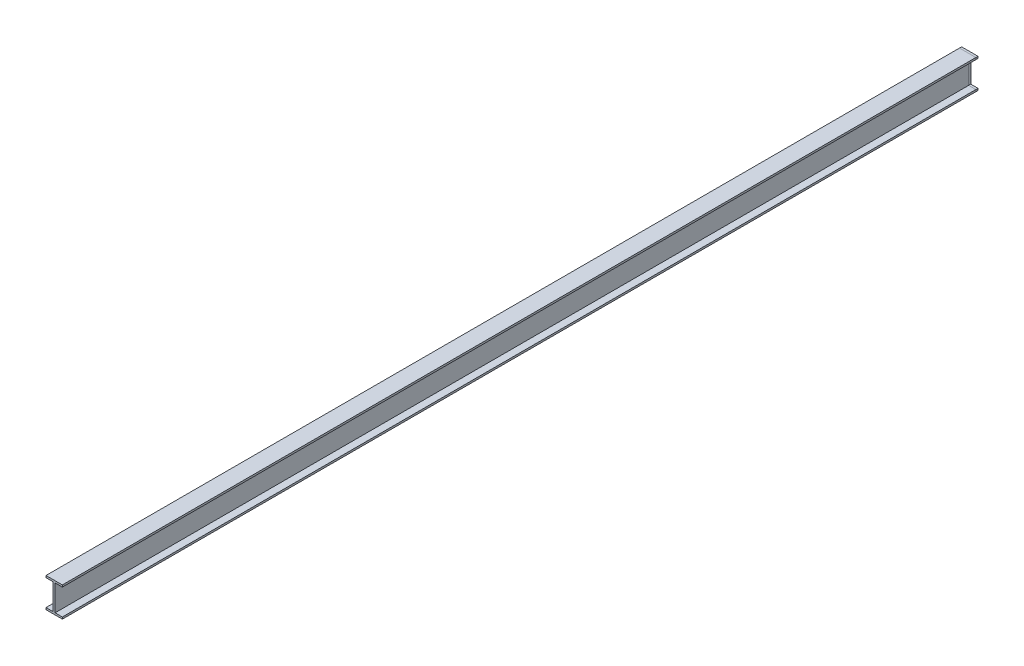
ISO-10303-21;
HEADER;
FILE_DESCRIPTION(('STEP AP214'),'2;1');
FILE_NAME('part.step','',(''),(''),'','','');
FILE_SCHEMA(('AUTOMOTIVE_DESIGN { 1 0 10303 214 1 1 1 1 }'));
ENDSEC;
DATA;
#1=APPLICATION_CONTEXT('core data for automotive mechanical design processes');
#2=APPLICATION_PROTOCOL_DEFINITION('international standard','automotive_design',2000,#1);
#3=PRODUCT_CONTEXT('',#1,'mechanical');
#4=PRODUCT('Part','Part','',(#3));
#5=PRODUCT_RELATED_PRODUCT_CATEGORY('part','',(#4));
#6=PRODUCT_DEFINITION_FORMATION('','',#4);
#7=PRODUCT_DEFINITION_CONTEXT('part definition',#1,'design');
#8=PRODUCT_DEFINITION('design','',#6,#7);
#9=PRODUCT_DEFINITION_SHAPE('','',#8);
#10=(LENGTH_UNIT() NAMED_UNIT(*) SI_UNIT(.MILLI.,.METRE.));
#11=(NAMED_UNIT(*) PLANE_ANGLE_UNIT() SI_UNIT($,.RADIAN.));
#12=(NAMED_UNIT(*) SI_UNIT($,.STERADIAN.) SOLID_ANGLE_UNIT());
#13=UNCERTAINTY_MEASURE_WITH_UNIT(LENGTH_MEASURE(1.E-05),#10,'distance_accuracy_value','');
#14=(GEOMETRIC_REPRESENTATION_CONTEXT(3) GLOBAL_UNCERTAINTY_ASSIGNED_CONTEXT((#13)) GLOBAL_UNIT_ASSIGNED_CONTEXT((#10,
#11,#12)) REPRESENTATION_CONTEXT('',''));
#15=CARTESIAN_POINT('',(0.,0.,0.));
#16=DIRECTION('',(0.,0.,1.));
#17=DIRECTION('',(1.,0.,0.));
#18=AXIS2_PLACEMENT_3D('',#15,#16,#17);
#19=CARTESIAN_POINT('',(0.,177.8,5486.4));
#20=DIRECTION('',(0.,1.,0.));
#21=DIRECTION('',(0.,0.,1.));
#22=AXIS2_PLACEMENT_3D('',#19,#20,#21);
#23=PLANE('',#22);
#24=DIRECTION('',(0.,0.,-1.));
#25=VECTOR('',#24,1.);
#26=CARTESIAN_POINT('',(-49.022,177.8,5486.4));
#27=LINE('',#26,#25);
#28=CARTESIAN_POINT('',(-49.022,177.8,12.6999999999997));
#29=VERTEX_POINT('',#28);
#30=CARTESIAN_POINT('',(-49.022,177.8,0.));
#31=VERTEX_POINT('',#30);
#32=EDGE_CURVE('E217',#29,#31,#27,.T.);
#33=ORIENTED_EDGE('',*,*,#32,.F.);
#34=DIRECTION('',(1.,0.,0.));
#35=VECTOR('',#34,1.);
#36=CARTESIAN_POINT('',(0.,177.8,12.6999999999997));
#37=LINE('',#36,#35);
#38=CARTESIAN_POINT('',(49.022,177.8,12.6999999999997));
#39=VERTEX_POINT('',#38);
#40=EDGE_CURVE('E12',#29,#39,#37,.T.);
#41=ORIENTED_EDGE('',*,*,#40,.T.);
#42=DIRECTION('',(0.,0.,-1.));
#43=VECTOR('',#42,1.);
#44=CARTESIAN_POINT('',(49.022,177.8,5486.4));
#45=LINE('',#44,#43);
#46=CARTESIAN_POINT('',(49.022,177.8,0.));
#47=VERTEX_POINT('',#46);
#48=EDGE_CURVE('E252',#39,#47,#45,.T.);
#49=ORIENTED_EDGE('',*,*,#48,.T.);
#50=DIRECTION('',(1.,0.,0.));
#51=VECTOR('',#50,1.);
#52=CARTESIAN_POINT('',(0.,177.8,0.));
#53=LINE('',#52,#51);
#54=EDGE_CURVE('E190',#31,#47,#53,.T.);
#55=ORIENTED_EDGE('',*,*,#54,.F.);
#56=EDGE_LOOP('',(#33,#41,#49,#55));
#57=FACE_BOUND('',#56,.T.);
#58=ADVANCED_FACE('F41',(#57),#23,.T.);
#59=CARTESIAN_POINT('',(49.022,0.,5486.4));
#60=DIRECTION('',(-1.,0.,0.));
#61=DIRECTION('',(0.,0.,1.));
#62=AXIS2_PLACEMENT_3D('',#59,#60,#61);
#63=PLANE('',#62);
#64=DIRECTION('',(0.,0.,-1.));
#65=VECTOR('',#64,1.);
#66=CARTESIAN_POINT('',(49.022,166.37,5486.4));
#67=LINE('',#66,#65);
#68=CARTESIAN_POINT('',(49.022,166.37,5486.4));
#69=VERTEX_POINT('',#68);
#70=CARTESIAN_POINT('',(49.022,166.37,12.6999999999997));
#71=VERTEX_POINT('',#70);
#72=EDGE_CURVE('E257',#69,#71,#67,.T.);
#73=ORIENTED_EDGE('',*,*,#72,.T.);
#74=DIRECTION('',(0.,1.,0.));
#75=VECTOR('',#74,1.);
#76=CARTESIAN_POINT('',(49.022,0.,12.6999999999997));
#77=LINE('',#76,#75);
#78=EDGE_CURVE('E49',#71,#39,#77,.T.);
#79=ORIENTED_EDGE('',*,*,#78,.T.);
#80=CARTESIAN_POINT('',(49.022,177.8,5486.4));
#81=VERTEX_POINT('',#80);
#82=EDGE_CURVE('E253',#81,#39,#45,.T.);
#83=ORIENTED_EDGE('',*,*,#82,.F.);
#84=DIRECTION('',(0.,1.,0.));
#85=VECTOR('',#84,1.);
#86=CARTESIAN_POINT('',(49.022,0.,5486.4));
#87=LINE('',#86,#85);
#88=EDGE_CURVE('E214',#69,#81,#87,.T.);
#89=ORIENTED_EDGE('',*,*,#88,.F.);
#90=EDGE_LOOP('',(#73,#79,#83,#89));
#91=FACE_BOUND('',#90,.T.);
#92=ADVANCED_FACE('F313',(#91),#63,.F.);
#93=CARTESIAN_POINT('',(0.,166.37,5486.4));
#94=DIRECTION('',(0.,1.,0.));
#95=DIRECTION('',(0.,0.,1.));
#96=AXIS2_PLACEMENT_3D('',#93,#94,#95);
#97=PLANE('',#96);
#98=DIRECTION('',(0.,0.,-1.));
#99=VECTOR('',#98,1.);
#100=CARTESIAN_POINT('',(5.715,166.37,5486.4));
#101=LINE('',#100,#99);
#102=CARTESIAN_POINT('',(5.715,166.37,5486.4));
#103=VERTEX_POINT('',#102);
#104=CARTESIAN_POINT('',(5.715,166.37,12.6999999999997));
#105=VERTEX_POINT('',#104);
#106=EDGE_CURVE('E261',#103,#105,#101,.T.);
#107=ORIENTED_EDGE('',*,*,#106,.T.);
#108=DIRECTION('',(1.,0.,0.));
#109=VECTOR('',#108,1.);
#110=CARTESIAN_POINT('',(0.,166.37,12.6999999999997));
#111=LINE('',#110,#109);
#112=EDGE_CURVE('E310',#105,#71,#111,.T.);
#113=ORIENTED_EDGE('',*,*,#112,.T.);
#114=ORIENTED_EDGE('',*,*,#72,.F.);
#115=DIRECTION('',(1.,0.,0.));
#116=VECTOR('',#115,1.);
#117=CARTESIAN_POINT('',(0.,166.37,5486.4));
#118=LINE('',#117,#116);
#119=EDGE_CURVE('E212',#103,#69,#118,.T.);
#120=ORIENTED_EDGE('',*,*,#119,.F.);
#121=EDGE_LOOP('',(#107,#113,#114,#120));
#122=FACE_BOUND('',#121,.T.);
#123=ADVANCED_FACE('F368',(#122),#97,.F.);
#124=CARTESIAN_POINT('',(5.715,0.,5486.4));
#125=DIRECTION('',(-1.,0.,0.));
#126=DIRECTION('',(0.,0.,1.));
#127=AXIS2_PLACEMENT_3D('',#124,#125,#126);
#128=PLANE('',#127);
#129=DIRECTION('',(0.,0.,-1.));
#130=VECTOR('',#129,1.);
#131=CARTESIAN_POINT('',(5.715,11.43,5486.4));
#132=LINE('',#131,#130);
#133=CARTESIAN_POINT('',(5.715,11.43,5486.4));
#134=VERTEX_POINT('',#133);
#135=CARTESIAN_POINT('',(5.715,11.43,12.6999999999997));
#136=VERTEX_POINT('',#135);
#137=EDGE_CURVE('E265',#134,#136,#132,.T.);
#138=ORIENTED_EDGE('',*,*,#137,.T.);
#139=DIRECTION('',(0.,1.,0.));
#140=VECTOR('',#139,1.);
#141=CARTESIAN_POINT('',(5.715,0.,12.6999999999997));
#142=LINE('',#141,#140);
#143=EDGE_CURVE('E307',#136,#105,#142,.T.);
#144=ORIENTED_EDGE('',*,*,#143,.T.);
#145=ORIENTED_EDGE('',*,*,#106,.F.);
#146=DIRECTION('',(0.,1.,0.));
#147=VECTOR('',#146,1.);
#148=CARTESIAN_POINT('',(5.715,0.,5486.4));
#149=LINE('',#148,#147);
#150=EDGE_CURVE('E210',#134,#103,#149,.T.);
#151=ORIENTED_EDGE('',*,*,#150,.F.);
#152=EDGE_LOOP('',(#138,#144,#145,#151));
#153=FACE_BOUND('',#152,.T.);
#154=ADVANCED_FACE('F365',(#153),#128,.F.);
#155=CARTESIAN_POINT('',(0.,11.43,5486.4));
#156=DIRECTION('',(0.,1.,0.));
#157=DIRECTION('',(0.,0.,1.));
#158=AXIS2_PLACEMENT_3D('',#155,#156,#157);
#159=PLANE('',#158);
#160=CARTESIAN_POINT('',(5.715,11.43,0.));
#161=VERTEX_POINT('',#160);
#162=EDGE_CURVE('E264',#136,#161,#132,.T.);
#163=ORIENTED_EDGE('',*,*,#162,.F.);
#164=DIRECTION('',(1.,0.,0.));
#165=VECTOR('',#164,1.);
#166=CARTESIAN_POINT('',(0.,11.43,12.6999999999997));
#167=LINE('',#166,#165);
#168=CARTESIAN_POINT('',(49.022,11.43,12.6999999999997));
#169=VERTEX_POINT('',#168);
#170=EDGE_CURVE('E305',#136,#169,#167,.T.);
#171=ORIENTED_EDGE('',*,*,#170,.T.);
#172=DIRECTION('',(0.,0.,-1.));
#173=VECTOR('',#172,1.);
#174=CARTESIAN_POINT('',(49.022,11.43,5486.4));
#175=LINE('',#174,#173);
#176=CARTESIAN_POINT('',(49.022,11.43,0.));
#177=VERTEX_POINT('',#176);
#178=EDGE_CURVE('E268',#169,#177,#175,.T.);
#179=ORIENTED_EDGE('',*,*,#178,.T.);
#180=DIRECTION('',(1.,0.,0.));
#181=VECTOR('',#180,1.);
#182=CARTESIAN_POINT('',(0.,11.43,0.));
#183=LINE('',#182,#181);
#184=EDGE_CURVE('E239',#161,#177,#183,.T.);
#185=ORIENTED_EDGE('',*,*,#184,.F.);
#186=EDGE_LOOP('',(#163,#171,#179,#185));
#187=FACE_BOUND('',#186,.T.);
#188=ADVANCED_FACE('F378',(#187),#159,.T.);
#189=CARTESIAN_POINT('',(49.022,0.,5486.4));
#190=DIRECTION('',(-1.,0.,0.));
#191=DIRECTION('',(0.,0.,1.));
#192=AXIS2_PLACEMENT_3D('',#189,#190,#191);
#193=PLANE('',#192);
#194=DIRECTION('',(0.,0.,-1.));
#195=VECTOR('',#194,1.);
#196=CARTESIAN_POINT('',(49.022,0.,5486.4));
#197=LINE('',#196,#195);
#198=CARTESIAN_POINT('',(49.022,0.,5486.4));
#199=VERTEX_POINT('',#198);
#200=CARTESIAN_POINT('',(49.022,0.,12.6999999999997));
#201=VERTEX_POINT('',#200);
#202=EDGE_CURVE('E273',#199,#201,#197,.T.);
#203=ORIENTED_EDGE('',*,*,#202,.T.);
#204=DIRECTION('',(0.,1.,0.));
#205=VECTOR('',#204,1.);
#206=CARTESIAN_POINT('',(49.022,0.,12.6999999999997));
#207=LINE('',#206,#205);
#208=EDGE_CURVE('E302',#201,#169,#207,.T.);
#209=ORIENTED_EDGE('',*,*,#208,.T.);
#210=CARTESIAN_POINT('',(49.022,11.43,5486.4));
#211=VERTEX_POINT('',#210);
#212=EDGE_CURVE('E269',#211,#169,#175,.T.);
#213=ORIENTED_EDGE('',*,*,#212,.F.);
#214=DIRECTION('',(0.,1.,0.));
#215=VECTOR('',#214,1.);
#216=CARTESIAN_POINT('',(49.022,0.,5486.4));
#217=LINE('',#216,#215);
#218=EDGE_CURVE('E205',#199,#211,#217,.T.);
#219=ORIENTED_EDGE('',*,*,#218,.F.);
#220=EDGE_LOOP('',(#203,#209,#213,#219));
#221=FACE_BOUND('',#220,.T.);
#222=ADVANCED_FACE('F356',(#221),#193,.F.);
#223=CARTESIAN_POINT('',(0.,0.,5486.4));
#224=DIRECTION('',(0.,1.,0.));
#225=DIRECTION('',(0.,0.,1.));
#226=AXIS2_PLACEMENT_3D('',#223,#224,#225);
#227=PLANE('',#226);
#228=DIRECTION('',(0.,0.,-1.));
#229=VECTOR('',#228,1.);
#230=CARTESIAN_POINT('',(-49.022,0.,5486.4));
#231=LINE('',#230,#229);
#232=CARTESIAN_POINT('',(-49.022,0.,5486.4));
#233=VERTEX_POINT('',#232);
#234=CARTESIAN_POINT('',(-49.022,0.,12.6999999999997));
#235=VERTEX_POINT('',#234);
#236=EDGE_CURVE('E277',#233,#235,#231,.T.);
#237=ORIENTED_EDGE('',*,*,#236,.T.);
#238=DIRECTION('',(1.,0.,0.));
#239=VECTOR('',#238,1.);
#240=CARTESIAN_POINT('',(0.,0.,12.6999999999997));
#241=LINE('',#240,#239);
#242=EDGE_CURVE('E299',#235,#201,#241,.T.);
#243=ORIENTED_EDGE('',*,*,#242,.T.);
#244=ORIENTED_EDGE('',*,*,#202,.F.);
#245=DIRECTION('',(1.,0.,0.));
#246=VECTOR('',#245,1.);
#247=CARTESIAN_POINT('',(0.,0.,5486.4));
#248=LINE('',#247,#246);
#249=EDGE_CURVE('E203',#233,#199,#248,.T.);
#250=ORIENTED_EDGE('',*,*,#249,.F.);
#251=EDGE_LOOP('',(#237,#243,#244,#250));
#252=FACE_BOUND('',#251,.T.);
#253=ADVANCED_FACE('F353',(#252),#227,.F.);
#254=CARTESIAN_POINT('',(-49.022,0.,5486.4));
#255=DIRECTION('',(-1.,0.,0.));
#256=DIRECTION('',(0.,0.,1.));
#257=AXIS2_PLACEMENT_3D('',#254,#255,#256);
#258=PLANE('',#257);
#259=CARTESIAN_POINT('',(-49.022,0.,0.));
#260=VERTEX_POINT('',#259);
#261=EDGE_CURVE('E276',#235,#260,#231,.T.);
#262=ORIENTED_EDGE('',*,*,#261,.F.);
#263=DIRECTION('',(0.,1.,0.));
#264=VECTOR('',#263,1.);
#265=CARTESIAN_POINT('',(-49.022,0.,12.6999999999997));
#266=LINE('',#265,#264);
#267=CARTESIAN_POINT('',(-49.022,11.43,12.6999999999997));
#268=VERTEX_POINT('',#267);
#269=EDGE_CURVE('E297',#235,#268,#266,.T.);
#270=ORIENTED_EDGE('',*,*,#269,.T.);
#271=DIRECTION('',(0.,0.,-1.));
#272=VECTOR('',#271,1.);
#273=CARTESIAN_POINT('',(-49.022,11.43,5486.4));
#274=LINE('',#273,#272);
#275=CARTESIAN_POINT('',(-49.022,11.43,0.));
#276=VERTEX_POINT('',#275);
#277=EDGE_CURVE('E280',#268,#276,#274,.T.);
#278=ORIENTED_EDGE('',*,*,#277,.T.);
#279=DIRECTION('',(0.,1.,0.));
#280=VECTOR('',#279,1.);
#281=CARTESIAN_POINT('',(-49.022,0.,0.));
#282=LINE('',#281,#280);
#283=EDGE_CURVE('E230',#260,#276,#282,.T.);
#284=ORIENTED_EDGE('',*,*,#283,.F.);
#285=EDGE_LOOP('',(#262,#270,#278,#284));
#286=FACE_BOUND('',#285,.T.);
#287=ADVANCED_FACE('F385',(#286),#258,.T.);
#288=CARTESIAN_POINT('',(0.,11.43,5486.4));
#289=DIRECTION('',(0.,1.,0.));
#290=DIRECTION('',(0.,0.,1.));
#291=AXIS2_PLACEMENT_3D('',#288,#289,#290);
#292=PLANE('',#291);
#293=ORIENTED_EDGE('',*,*,#277,.F.);
#294=DIRECTION('',(1.,0.,0.));
#295=VECTOR('',#294,1.);
#296=CARTESIAN_POINT('',(0.,11.43,12.6999999999997));
#297=LINE('',#296,#295);
#298=CARTESIAN_POINT('',(-5.715,11.43,12.6999999999997));
#299=VERTEX_POINT('',#298);
#300=EDGE_CURVE('E295',#268,#299,#297,.T.);
#301=ORIENTED_EDGE('',*,*,#300,.T.);
#302=DIRECTION('',(0.,0.,-1.));
#303=VECTOR('',#302,1.);
#304=CARTESIAN_POINT('',(-5.715,11.43,5486.4));
#305=LINE('',#304,#303);
#306=CARTESIAN_POINT('',(-5.715,11.43,0.));
#307=VERTEX_POINT('',#306);
#308=EDGE_CURVE('E284',#299,#307,#305,.T.);
#309=ORIENTED_EDGE('',*,*,#308,.T.);
#310=DIRECTION('',(1.,0.,0.));
#311=VECTOR('',#310,1.);
#312=CARTESIAN_POINT('',(0.,11.43,0.));
#313=LINE('',#312,#311);
#314=EDGE_CURVE('E227',#276,#307,#313,.T.);
#315=ORIENTED_EDGE('',*,*,#314,.F.);
#316=EDGE_LOOP('',(#293,#301,#309,#315));
#317=FACE_BOUND('',#316,.T.);
#318=ADVANCED_FACE('F388',(#317),#292,.T.);
#319=CARTESIAN_POINT('',(-5.715,0.,5486.4));
#320=DIRECTION('',(-1.,0.,0.));
#321=DIRECTION('',(0.,0.,1.));
#322=AXIS2_PLACEMENT_3D('',#319,#320,#321);
#323=PLANE('',#322);
#324=ORIENTED_EDGE('',*,*,#308,.F.);
#325=DIRECTION('',(0.,1.,0.));
#326=VECTOR('',#325,1.);
#327=CARTESIAN_POINT('',(-5.715,0.,12.6999999999997));
#328=LINE('',#327,#326);
#329=CARTESIAN_POINT('',(-5.715,166.37,12.6999999999997));
#330=VERTEX_POINT('',#329);
#331=EDGE_CURVE('E293',#299,#330,#328,.T.);
#332=ORIENTED_EDGE('',*,*,#331,.T.);
#333=DIRECTION('',(0.,0.,-1.));
#334=VECTOR('',#333,1.);
#335=CARTESIAN_POINT('',(-5.715,166.37,5486.4));
#336=LINE('',#335,#334);
#337=CARTESIAN_POINT('',(-5.715,166.37,0.));
#338=VERTEX_POINT('',#337);
#339=EDGE_CURVE('E288',#330,#338,#336,.T.);
#340=ORIENTED_EDGE('',*,*,#339,.T.);
#341=DIRECTION('',(0.,1.,0.));
#342=VECTOR('',#341,1.);
#343=CARTESIAN_POINT('',(-5.715,0.,0.));
#344=LINE('',#343,#342);
#345=EDGE_CURVE('E224',#307,#338,#344,.T.);
#346=ORIENTED_EDGE('',*,*,#345,.F.);
#347=EDGE_LOOP('',(#324,#332,#340,#346));
#348=FACE_BOUND('',#347,.T.);
#349=ADVANCED_FACE('F389',(#348),#323,.T.);
#350=CARTESIAN_POINT('',(0.,166.37,5486.4));
#351=DIRECTION('',(0.,1.,0.));
#352=DIRECTION('',(0.,0.,1.));
#353=AXIS2_PLACEMENT_3D('',#350,#351,#352);
#354=PLANE('',#353);
#355=DIRECTION('',(0.,0.,-1.));
#356=VECTOR('',#355,1.);
#357=CARTESIAN_POINT('',(-49.022,166.37,5486.4));
#358=LINE('',#357,#356);
#359=CARTESIAN_POINT('',(-49.022,166.37,5486.4));
#360=VERTEX_POINT('',#359);
#361=CARTESIAN_POINT('',(-49.022,166.37,12.6999999999997));
#362=VERTEX_POINT('',#361);
#363=EDGE_CURVE('E164',#360,#362,#358,.T.);
#364=ORIENTED_EDGE('',*,*,#363,.T.);
#365=DIRECTION('',(1.,0.,0.));
#366=VECTOR('',#365,1.);
#367=CARTESIAN_POINT('',(0.,166.37,12.6999999999997));
#368=LINE('',#367,#366);
#369=EDGE_CURVE('E291',#362,#330,#368,.T.);
#370=ORIENTED_EDGE('',*,*,#369,.T.);
#371=CARTESIAN_POINT('',(-5.715,166.37,5486.4));
#372=VERTEX_POINT('',#371);
#373=EDGE_CURVE('E181',#372,#330,#336,.T.);
#374=ORIENTED_EDGE('',*,*,#373,.F.);
#375=DIRECTION('',(1.,0.,0.));
#376=VECTOR('',#375,1.);
#377=CARTESIAN_POINT('',(0.,166.37,5486.4));
#378=LINE('',#377,#376);
#379=EDGE_CURVE('E178',#360,#372,#378,.T.);
#380=ORIENTED_EDGE('',*,*,#379,.F.);
#381=EDGE_LOOP('',(#364,#370,#374,#380));
#382=FACE_BOUND('',#381,.T.);
#383=ADVANCED_FACE('F179',(#382),#354,.F.);
#384=CARTESIAN_POINT('',(-49.022,0.,5486.4));
#385=DIRECTION('',(-1.,0.,0.));
#386=DIRECTION('',(0.,0.,1.));
#387=AXIS2_PLACEMENT_3D('',#384,#385,#386);
#388=PLANE('',#387);
#389=CARTESIAN_POINT('',(-49.022,166.37,0.));
#390=VERTEX_POINT('',#389);
#391=EDGE_CURVE('E175',#362,#390,#358,.T.);
#392=ORIENTED_EDGE('',*,*,#391,.F.);
#393=DIRECTION('',(0.,1.,0.));
#394=VECTOR('',#393,1.);
#395=CARTESIAN_POINT('',(-49.022,0.,12.6999999999997));
#396=LINE('',#395,#394);
#397=EDGE_CURVE('E171',#362,#29,#396,.T.);
#398=ORIENTED_EDGE('',*,*,#397,.T.);
#399=ORIENTED_EDGE('',*,*,#32,.T.);
#400=DIRECTION('',(0.,1.,0.));
#401=VECTOR('',#400,1.);
#402=CARTESIAN_POINT('',(-49.022,0.,0.));
#403=LINE('',#402,#401);
#404=EDGE_CURVE('E218',#390,#31,#403,.T.);
#405=ORIENTED_EDGE('',*,*,#404,.F.);
#406=EDGE_LOOP('',(#392,#398,#399,#405));
#407=FACE_BOUND('',#406,.T.);
#408=ADVANCED_FACE('F322',(#407),#388,.T.);
#409=ORIENTED_EDGE('',*,*,#397,.F.);
#410=ORIENTED_EDGE('',*,*,#363,.F.);
#411=DIRECTION('',(0.,1.,0.));
#412=VECTOR('',#411,1.);
#413=CARTESIAN_POINT('',(-49.022,0.,5486.4));
#414=LINE('',#413,#412);
#415=CARTESIAN_POINT('',(-49.022,177.8,5486.4));
#416=VERTEX_POINT('',#415);
#417=EDGE_CURVE('E168',#360,#416,#414,.T.);
#418=ORIENTED_EDGE('',*,*,#417,.T.);
#419=EDGE_CURVE('E250',#416,#29,#27,.T.);
#420=ORIENTED_EDGE('',*,*,#419,.T.);
#421=EDGE_LOOP('',(#409,#410,#418,#420));
#422=FACE_BOUND('',#421,.T.);
#423=ADVANCED_FACE('F43',(#422),#388,.T.);
#424=ORIENTED_EDGE('',*,*,#369,.F.);
#425=ORIENTED_EDGE('',*,*,#391,.T.);
#426=DIRECTION('',(1.,0.,0.));
#427=VECTOR('',#426,1.);
#428=CARTESIAN_POINT('',(0.,166.37,0.));
#429=LINE('',#428,#427);
#430=EDGE_CURVE('E221',#390,#338,#429,.T.);
#431=ORIENTED_EDGE('',*,*,#430,.T.);
#432=ORIENTED_EDGE('',*,*,#339,.F.);
#433=EDGE_LOOP('',(#424,#425,#431,#432));
#434=FACE_BOUND('',#433,.T.);
#435=ADVANCED_FACE('F331',(#434),#354,.F.);
#436=ORIENTED_EDGE('',*,*,#331,.F.);
#437=CARTESIAN_POINT('',(-5.715,11.43,5486.4));
#438=VERTEX_POINT('',#437);
#439=EDGE_CURVE('E285',#438,#299,#305,.T.);
#440=ORIENTED_EDGE('',*,*,#439,.F.);
#441=DIRECTION('',(0.,1.,0.));
#442=VECTOR('',#441,1.);
#443=CARTESIAN_POINT('',(-5.715,0.,5486.4));
#444=LINE('',#443,#442);
#445=EDGE_CURVE('E185',#438,#372,#444,.T.);
#446=ORIENTED_EDGE('',*,*,#445,.T.);
#447=ORIENTED_EDGE('',*,*,#373,.T.);
#448=EDGE_LOOP('',(#436,#440,#446,#447));
#449=FACE_BOUND('',#448,.T.);
#450=ADVANCED_FACE('F335',(#449),#323,.T.);
#451=ORIENTED_EDGE('',*,*,#300,.F.);
#452=CARTESIAN_POINT('',(-49.022,11.43,5486.4));
#453=VERTEX_POINT('',#452);
#454=EDGE_CURVE('E281',#453,#268,#274,.T.);
#455=ORIENTED_EDGE('',*,*,#454,.F.);
#456=DIRECTION('',(1.,0.,0.));
#457=VECTOR('',#456,1.);
#458=CARTESIAN_POINT('',(0.,11.43,5486.4));
#459=LINE('',#458,#457);
#460=EDGE_CURVE('E197',#453,#438,#459,.T.);
#461=ORIENTED_EDGE('',*,*,#460,.T.);
#462=ORIENTED_EDGE('',*,*,#439,.T.);
#463=EDGE_LOOP('',(#451,#455,#461,#462));
#464=FACE_BOUND('',#463,.T.);
#465=ADVANCED_FACE('F341',(#464),#292,.T.);
#466=ORIENTED_EDGE('',*,*,#269,.F.);
#467=ORIENTED_EDGE('',*,*,#236,.F.);
#468=DIRECTION('',(0.,1.,0.));
#469=VECTOR('',#468,1.);
#470=CARTESIAN_POINT('',(-49.022,0.,5486.4));
#471=LINE('',#470,#469);
#472=EDGE_CURVE('E200',#233,#453,#471,.T.);
#473=ORIENTED_EDGE('',*,*,#472,.T.);
#474=ORIENTED_EDGE('',*,*,#454,.T.);
#475=EDGE_LOOP('',(#466,#467,#473,#474));
#476=FACE_BOUND('',#475,.T.);
#477=ADVANCED_FACE('F345',(#476),#258,.T.);
#478=ORIENTED_EDGE('',*,*,#242,.F.);
#479=ORIENTED_EDGE('',*,*,#261,.T.);
#480=DIRECTION('',(1.,0.,0.));
#481=VECTOR('',#480,1.);
#482=CARTESIAN_POINT('',(0.,0.,0.));
#483=LINE('',#482,#481);
#484=CARTESIAN_POINT('',(49.022,0.,0.));
#485=VERTEX_POINT('',#484);
#486=EDGE_CURVE('E233',#260,#485,#483,.T.);
#487=ORIENTED_EDGE('',*,*,#486,.T.);
#488=EDGE_CURVE('E272',#201,#485,#197,.T.);
#489=ORIENTED_EDGE('',*,*,#488,.F.);
#490=EDGE_LOOP('',(#478,#479,#487,#489));
#491=FACE_BOUND('',#490,.T.);
#492=ADVANCED_FACE('F423',(#491),#227,.F.);
#493=ORIENTED_EDGE('',*,*,#208,.F.);
#494=ORIENTED_EDGE('',*,*,#488,.T.);
#495=DIRECTION('',(0.,1.,0.));
#496=VECTOR('',#495,1.);
#497=CARTESIAN_POINT('',(49.022,0.,0.));
#498=LINE('',#497,#496);
#499=EDGE_CURVE('E236',#485,#177,#498,.T.);
#500=ORIENTED_EDGE('',*,*,#499,.T.);
#501=ORIENTED_EDGE('',*,*,#178,.F.);
#502=EDGE_LOOP('',(#493,#494,#500,#501));
#503=FACE_BOUND('',#502,.T.);
#504=ADVANCED_FACE('F380',(#503),#193,.F.);
#505=ORIENTED_EDGE('',*,*,#170,.F.);
#506=ORIENTED_EDGE('',*,*,#137,.F.);
#507=DIRECTION('',(1.,0.,0.));
#508=VECTOR('',#507,1.);
#509=CARTESIAN_POINT('',(0.,11.43,5486.4));
#510=LINE('',#509,#508);
#511=EDGE_CURVE('E207',#134,#211,#510,.T.);
#512=ORIENTED_EDGE('',*,*,#511,.T.);
#513=ORIENTED_EDGE('',*,*,#212,.T.);
#514=EDGE_LOOP('',(#505,#506,#512,#513));
#515=FACE_BOUND('',#514,.T.);
#516=ADVANCED_FACE('F360',(#515),#159,.T.);
#517=ORIENTED_EDGE('',*,*,#143,.F.);
#518=ORIENTED_EDGE('',*,*,#162,.T.);
#519=DIRECTION('',(0.,1.,0.));
#520=VECTOR('',#519,1.);
#521=CARTESIAN_POINT('',(5.715,0.,0.));
#522=LINE('',#521,#520);
#523=CARTESIAN_POINT('',(5.715,166.37,0.));
#524=VERTEX_POINT('',#523);
#525=EDGE_CURVE('E242',#161,#524,#522,.T.);
#526=ORIENTED_EDGE('',*,*,#525,.T.);
#527=EDGE_CURVE('E260',#105,#524,#101,.T.);
#528=ORIENTED_EDGE('',*,*,#527,.F.);
#529=EDGE_LOOP('',(#517,#518,#526,#528));
#530=FACE_BOUND('',#529,.T.);
#531=ADVANCED_FACE('F414',(#530),#128,.F.);
#532=ORIENTED_EDGE('',*,*,#112,.F.);
#533=ORIENTED_EDGE('',*,*,#527,.T.);
#534=DIRECTION('',(1.,0.,0.));
#535=VECTOR('',#534,1.);
#536=CARTESIAN_POINT('',(0.,166.37,0.));
#537=LINE('',#536,#535);
#538=CARTESIAN_POINT('',(49.022,166.37,0.));
#539=VERTEX_POINT('',#538);
#540=EDGE_CURVE('E245',#524,#539,#537,.T.);
#541=ORIENTED_EDGE('',*,*,#540,.T.);
#542=EDGE_CURVE('E256',#71,#539,#67,.T.);
#543=ORIENTED_EDGE('',*,*,#542,.F.);
#544=EDGE_LOOP('',(#532,#533,#541,#543));
#545=FACE_BOUND('',#544,.T.);
#546=ADVANCED_FACE('F371',(#545),#97,.F.);
#547=ORIENTED_EDGE('',*,*,#78,.F.);
#548=ORIENTED_EDGE('',*,*,#542,.T.);
#549=DIRECTION('',(0.,1.,0.));
#550=VECTOR('',#549,1.);
#551=CARTESIAN_POINT('',(49.022,0.,0.));
#552=LINE('',#551,#550);
#553=EDGE_CURVE('E193',#539,#47,#552,.T.);
#554=ORIENTED_EDGE('',*,*,#553,.T.);
#555=ORIENTED_EDGE('',*,*,#48,.F.);
#556=EDGE_LOOP('',(#547,#548,#554,#555));
#557=FACE_BOUND('',#556,.T.);
#558=ADVANCED_FACE('F316',(#557),#63,.F.);
#559=ORIENTED_EDGE('',*,*,#40,.F.);
#560=ORIENTED_EDGE('',*,*,#419,.F.);
#561=DIRECTION('',(1.,0.,0.));
#562=VECTOR('',#561,1.);
#563=CARTESIAN_POINT('',(0.,177.8,5486.4));
#564=LINE('',#563,#562);
#565=EDGE_CURVE('E189',#416,#81,#564,.T.);
#566=ORIENTED_EDGE('',*,*,#565,.T.);
#567=ORIENTED_EDGE('',*,*,#82,.T.);
#568=EDGE_LOOP('',(#559,#560,#566,#567));
#569=FACE_BOUND('',#568,.T.);
#570=ADVANCED_FACE('F320',(#569),#23,.T.);
#571=CARTESIAN_POINT('',(0.,0.,5486.4));
#572=DIRECTION('',(0.,0.,1.));
#573=DIRECTION('',(1.,0.,0.));
#574=AXIS2_PLACEMENT_3D('',#571,#572,#573);
#575=PLANE('',#574);
#576=ORIENTED_EDGE('',*,*,#417,.F.);
#577=ORIENTED_EDGE('',*,*,#379,.T.);
#578=ORIENTED_EDGE('',*,*,#445,.F.);
#579=ORIENTED_EDGE('',*,*,#460,.F.);
#580=ORIENTED_EDGE('',*,*,#472,.F.);
#581=ORIENTED_EDGE('',*,*,#249,.T.);
#582=ORIENTED_EDGE('',*,*,#218,.T.);
#583=ORIENTED_EDGE('',*,*,#511,.F.);
#584=ORIENTED_EDGE('',*,*,#150,.T.);
#585=ORIENTED_EDGE('',*,*,#119,.T.);
#586=ORIENTED_EDGE('',*,*,#88,.T.);
#587=ORIENTED_EDGE('',*,*,#565,.F.);
#588=EDGE_LOOP('',(#576,#577,#578,#579,#580,#581,#582,#583,#584,#585,#586,#587));
#589=FACE_BOUND('',#588,.T.);
#590=ADVANCED_FACE('F187',(#589),#575,.T.);
#591=CARTESIAN_POINT('',(0.,0.,0.));
#592=DIRECTION('',(0.,0.,1.));
#593=DIRECTION('',(1.,0.,0.));
#594=AXIS2_PLACEMENT_3D('',#591,#592,#593);
#595=PLANE('',#594);
#596=ORIENTED_EDGE('',*,*,#404,.T.);
#597=ORIENTED_EDGE('',*,*,#54,.T.);
#598=ORIENTED_EDGE('',*,*,#553,.F.);
#599=ORIENTED_EDGE('',*,*,#540,.F.);
#600=ORIENTED_EDGE('',*,*,#525,.F.);
#601=ORIENTED_EDGE('',*,*,#184,.T.);
#602=ORIENTED_EDGE('',*,*,#499,.F.);
#603=ORIENTED_EDGE('',*,*,#486,.F.);
#604=ORIENTED_EDGE('',*,*,#283,.T.);
#605=ORIENTED_EDGE('',*,*,#314,.T.);
#606=ORIENTED_EDGE('',*,*,#345,.T.);
#607=ORIENTED_EDGE('',*,*,#430,.F.);
#608=EDGE_LOOP('',(#596,#597,#598,#599,#600,#601,#602,#603,#604,#605,#606,#607));
#609=FACE_BOUND('',#608,.T.);
#610=ADVANCED_FACE('F325',(#609),#595,.F.);
#611=CLOSED_SHELL('',(#58,#92,#123,#154,#188,#222,#253,#287,#318,#349,#383,#408,#423,#435,#450,
#465,#477,#492,#504,#516,#531,#546,#558,#570,#590,#610));
#612=MANIFOLD_SOLID_BREP('B2',#611);
#613=ADVANCED_BREP_SHAPE_REPRESENTATION('',(#18,#612),#14);
#614=SHAPE_DEFINITION_REPRESENTATION(#9,#613);
ENDSEC;
END-ISO-10303-21;
